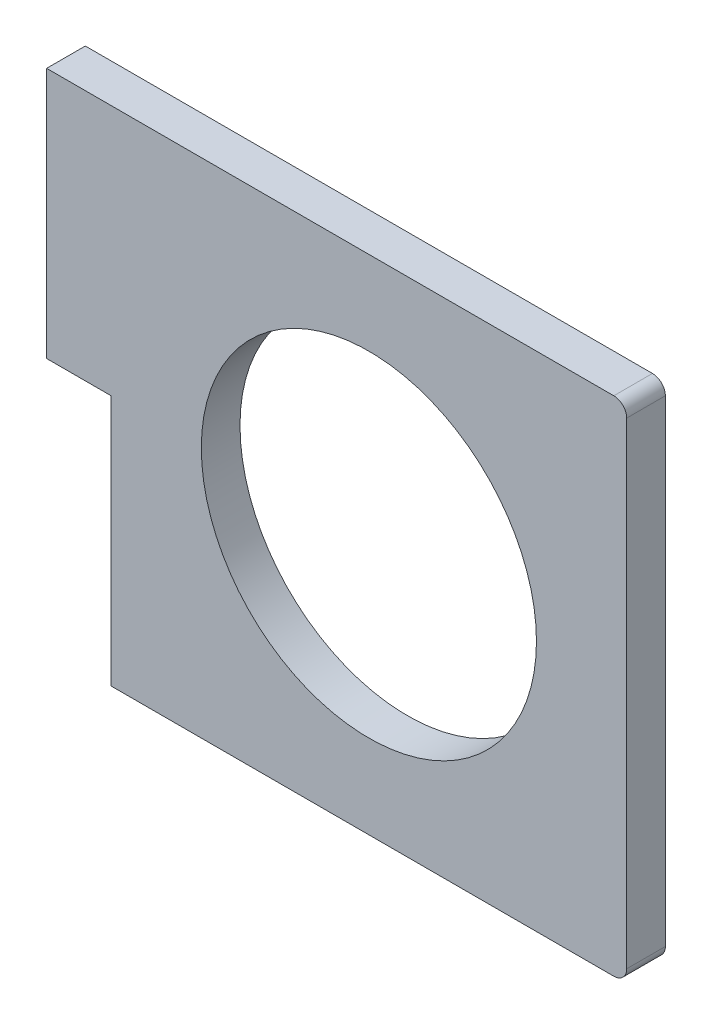
ISO-10303-21;
HEADER;
FILE_DESCRIPTION(('STEP AP214'),'2;1');
FILE_NAME('part.step','',(''),(''),'','','');
FILE_SCHEMA(('AUTOMOTIVE_DESIGN { 1 0 10303 214 1 1 1 1 }'));
ENDSEC;
DATA;
#1=APPLICATION_CONTEXT('core data for automotive mechanical design processes');
#2=APPLICATION_PROTOCOL_DEFINITION('international standard','automotive_design',2000,#1);
#3=PRODUCT_CONTEXT('',#1,'mechanical');
#4=PRODUCT('Part','Part','',(#3));
#5=PRODUCT_RELATED_PRODUCT_CATEGORY('part','',(#4));
#6=PRODUCT_DEFINITION_FORMATION('','',#4);
#7=PRODUCT_DEFINITION_CONTEXT('part definition',#1,'design');
#8=PRODUCT_DEFINITION('design','',#6,#7);
#9=PRODUCT_DEFINITION_SHAPE('','',#8);
#10=(LENGTH_UNIT() NAMED_UNIT(*) SI_UNIT(.MILLI.,.METRE.));
#11=(NAMED_UNIT(*) PLANE_ANGLE_UNIT() SI_UNIT($,.RADIAN.));
#12=(NAMED_UNIT(*) SI_UNIT($,.STERADIAN.) SOLID_ANGLE_UNIT());
#13=UNCERTAINTY_MEASURE_WITH_UNIT(LENGTH_MEASURE(1.E-05),#10,'distance_accuracy_value','');
#14=(GEOMETRIC_REPRESENTATION_CONTEXT(3) GLOBAL_UNCERTAINTY_ASSIGNED_CONTEXT((#13)) GLOBAL_UNIT_ASSIGNED_CONTEXT((#10,
#11,#12)) REPRESENTATION_CONTEXT('',''));
#15=CARTESIAN_POINT('',(0.,0.,0.));
#16=DIRECTION('',(0.,0.,1.));
#17=DIRECTION('',(1.,0.,0.));
#18=AXIS2_PLACEMENT_3D('',#15,#16,#17);
#19=CARTESIAN_POINT('',(0.,0.,6.));
#20=DIRECTION('',(0.,0.,1.));
#21=DIRECTION('',(1.,0.,0.));
#22=AXIS2_PLACEMENT_3D('',#19,#20,#21);
#23=PLANE('',#22);
#24=DIRECTION('',(1.,0.,0.));
#25=VECTOR('',#24,1.);
#26=CARTESIAN_POINT('',(0.,0.,6.));
#27=LINE('',#26,#25);
#28=CARTESIAN_POINT('',(0.,0.,6.));
#29=VERTEX_POINT('',#28);
#30=CARTESIAN_POINT('',(78.,0.,6.));
#31=VERTEX_POINT('',#30);
#32=EDGE_CURVE('E110',#29,#31,#27,.T.);
#33=ORIENTED_EDGE('',*,*,#32,.T.);
#34=CARTESIAN_POINT('',(78.,2.,6.));
#35=DIRECTION('',(0.,0.,1.));
#36=DIRECTION('',(1.,0.,0.));
#37=AXIS2_PLACEMENT_3D('',#34,#35,#36);
#38=CIRCLE('',#37,2.);
#39=CARTESIAN_POINT('',(80.,2.,6.));
#40=VERTEX_POINT('',#39);
#41=EDGE_CURVE('E53',#31,#40,#38,.T.);
#42=ORIENTED_EDGE('',*,*,#41,.T.);
#43=DIRECTION('',(0.,1.,0.));
#44=VECTOR('',#43,1.);
#45=CARTESIAN_POINT('',(80.,0.,6.));
#46=LINE('',#45,#44);
#47=CARTESIAN_POINT('',(80.,76.,6.));
#48=VERTEX_POINT('',#47);
#49=EDGE_CURVE('E118',#40,#48,#46,.T.);
#50=ORIENTED_EDGE('',*,*,#49,.T.);
#51=CARTESIAN_POINT('',(78.,76.,6.));
#52=DIRECTION('',(0.,0.,1.));
#53=DIRECTION('',(1.,0.,0.));
#54=AXIS2_PLACEMENT_3D('',#51,#52,#53);
#55=CIRCLE('',#54,2.);
#56=CARTESIAN_POINT('',(78.,78.,6.));
#57=VERTEX_POINT('',#56);
#58=EDGE_CURVE('E60',#48,#57,#55,.T.);
#59=ORIENTED_EDGE('',*,*,#58,.T.);
#60=DIRECTION('',(-1.,0.,0.));
#61=VECTOR('',#60,1.);
#62=CARTESIAN_POINT('',(0.,78.,6.));
#63=LINE('',#62,#61);
#64=CARTESIAN_POINT('',(-10.,78.,6.));
#65=VERTEX_POINT('',#64);
#66=EDGE_CURVE('E169',#57,#65,#63,.T.);
#67=ORIENTED_EDGE('',*,*,#66,.T.);
#68=DIRECTION('',(0.,-1.,0.));
#69=VECTOR('',#68,1.);
#70=CARTESIAN_POINT('',(-10.,78.,6.));
#71=LINE('',#70,#69);
#72=CARTESIAN_POINT('',(-9.99999999999999,39.,6.));
#73=VERTEX_POINT('',#72);
#74=EDGE_CURVE('E208',#65,#73,#71,.T.);
#75=ORIENTED_EDGE('',*,*,#74,.T.);
#76=DIRECTION('',(1.,0.,0.));
#77=VECTOR('',#76,1.);
#78=CARTESIAN_POINT('',(0.,39.,6.));
#79=LINE('',#78,#77);
#80=CARTESIAN_POINT('',(0.,39.,6.));
#81=VERTEX_POINT('',#80);
#82=EDGE_CURVE('E124',#73,#81,#79,.T.);
#83=ORIENTED_EDGE('',*,*,#82,.T.);
#84=DIRECTION('',(0.,-1.,0.));
#85=VECTOR('',#84,1.);
#86=CARTESIAN_POINT('',(0.,0.,6.));
#87=LINE('',#86,#85);
#88=EDGE_CURVE('E119',#81,#29,#87,.T.);
#89=ORIENTED_EDGE('',*,*,#88,.T.);
#90=EDGE_LOOP('',(#33,#42,#50,#59,#67,#75,#83,#89));
#91=FACE_BOUND('',#90,.T.);
#92=CARTESIAN_POINT('',(40.,39.,6.));
#93=DIRECTION('',(0.,0.,1.));
#94=DIRECTION('',(1.,0.,0.));
#95=AXIS2_PLACEMENT_3D('',#92,#93,#94);
#96=CIRCLE('',#95,26.);
#97=CARTESIAN_POINT('',(66.,39.,6.));
#98=VERTEX_POINT('',#97);
#99=EDGE_CURVE('E183',#98,#98,#96,.T.);
#100=ORIENTED_EDGE('',*,*,#99,.F.);
#101=EDGE_LOOP('',(#100));
#102=FACE_BOUND('',#101,.T.);
#103=ADVANCED_FACE('F44',(#91,#102),#23,.T.);
#104=CARTESIAN_POINT('',(0.,0.,0.));
#105=DIRECTION('',(0.,0.,1.));
#106=DIRECTION('',(1.,0.,0.));
#107=AXIS2_PLACEMENT_3D('',#104,#105,#106);
#108=PLANE('',#107);
#109=DIRECTION('',(0.,1.,0.));
#110=VECTOR('',#109,1.);
#111=CARTESIAN_POINT('',(80.,0.,0.));
#112=LINE('',#111,#110);
#113=CARTESIAN_POINT('',(80.,2.,0.));
#114=VERTEX_POINT('',#113);
#115=CARTESIAN_POINT('',(80.,76.,0.));
#116=VERTEX_POINT('',#115);
#117=EDGE_CURVE('E176',#114,#116,#112,.T.);
#118=ORIENTED_EDGE('',*,*,#117,.F.);
#119=CARTESIAN_POINT('',(78.,2.,0.));
#120=DIRECTION('',(0.,0.,1.));
#121=DIRECTION('',(1.,0.,0.));
#122=AXIS2_PLACEMENT_3D('',#119,#120,#121);
#123=CIRCLE('',#122,2.);
#124=CARTESIAN_POINT('',(78.,0.,0.));
#125=VERTEX_POINT('',#124);
#126=EDGE_CURVE('E153',#114,#125,#123,.F.);
#127=ORIENTED_EDGE('',*,*,#126,.T.);
#128=DIRECTION('',(1.,0.,0.));
#129=VECTOR('',#128,1.);
#130=CARTESIAN_POINT('',(0.,0.,0.));
#131=LINE('',#130,#129);
#132=CARTESIAN_POINT('',(0.,0.,0.));
#133=VERTEX_POINT('',#132);
#134=EDGE_CURVE('E175',#133,#125,#131,.T.);
#135=ORIENTED_EDGE('',*,*,#134,.F.);
#136=DIRECTION('',(0.,-1.,0.));
#137=VECTOR('',#136,1.);
#138=CARTESIAN_POINT('',(0.,0.,0.));
#139=LINE('',#138,#137);
#140=CARTESIAN_POINT('',(0.,39.,0.));
#141=VERTEX_POINT('',#140);
#142=EDGE_CURVE('E133',#141,#133,#139,.T.);
#143=ORIENTED_EDGE('',*,*,#142,.F.);
#144=DIRECTION('',(1.,0.,0.));
#145=VECTOR('',#144,1.);
#146=CARTESIAN_POINT('',(0.,39.,0.));
#147=LINE('',#146,#145);
#148=CARTESIAN_POINT('',(-9.99999999999999,39.,0.));
#149=VERTEX_POINT('',#148);
#150=EDGE_CURVE('E129',#149,#141,#147,.T.);
#151=ORIENTED_EDGE('',*,*,#150,.F.);
#152=DIRECTION('',(0.,-1.,0.));
#153=VECTOR('',#152,1.);
#154=CARTESIAN_POINT('',(-10.,78.,0.));
#155=LINE('',#154,#153);
#156=CARTESIAN_POINT('',(-10.,78.,0.));
#157=VERTEX_POINT('',#156);
#158=EDGE_CURVE('E189',#157,#149,#155,.T.);
#159=ORIENTED_EDGE('',*,*,#158,.F.);
#160=DIRECTION('',(-1.,0.,0.));
#161=VECTOR('',#160,1.);
#162=CARTESIAN_POINT('',(0.,78.,0.));
#163=LINE('',#162,#161);
#164=CARTESIAN_POINT('',(78.,78.,0.));
#165=VERTEX_POINT('',#164);
#166=EDGE_CURVE('E181',#165,#157,#163,.T.);
#167=ORIENTED_EDGE('',*,*,#166,.F.);
#168=CARTESIAN_POINT('',(78.,76.,0.));
#169=DIRECTION('',(0.,0.,1.));
#170=DIRECTION('',(1.,0.,0.));
#171=AXIS2_PLACEMENT_3D('',#168,#169,#170);
#172=CIRCLE('',#171,2.);
#173=EDGE_CURVE('E150',#165,#116,#172,.F.);
#174=ORIENTED_EDGE('',*,*,#173,.T.);
#175=EDGE_LOOP('',(#118,#127,#135,#143,#151,#159,#167,#174));
#176=FACE_BOUND('',#175,.T.);
#177=CARTESIAN_POINT('',(40.,39.,0.));
#178=DIRECTION('',(0.,0.,1.));
#179=DIRECTION('',(1.,0.,0.));
#180=AXIS2_PLACEMENT_3D('',#177,#178,#179);
#181=CIRCLE('',#180,26.);
#182=CARTESIAN_POINT('',(66.,39.,0.));
#183=VERTEX_POINT('',#182);
#184=EDGE_CURVE('E309',#183,#183,#181,.T.);
#185=ORIENTED_EDGE('',*,*,#184,.T.);
#186=EDGE_LOOP('',(#185));
#187=FACE_BOUND('',#186,.T.);
#188=ADVANCED_FACE('F173',(#176,#187),#108,.F.);
#189=CARTESIAN_POINT('',(0.,0.,6.));
#190=DIRECTION('',(1.,0.,0.));
#191=DIRECTION('',(0.,1.,0.));
#192=AXIS2_PLACEMENT_3D('',#189,#190,#191);
#193=PLANE('',#192);
#194=ORIENTED_EDGE('',*,*,#142,.T.);
#195=DIRECTION('',(0.,0.,-1.));
#196=VECTOR('',#195,1.);
#197=CARTESIAN_POINT('',(0.,0.,6.));
#198=LINE('',#197,#196);
#199=EDGE_CURVE('E114',#29,#133,#198,.T.);
#200=ORIENTED_EDGE('',*,*,#199,.F.);
#201=ORIENTED_EDGE('',*,*,#88,.F.);
#202=DIRECTION('',(0.,0.,-1.));
#203=VECTOR('',#202,1.);
#204=CARTESIAN_POINT('',(0.,39.,6.));
#205=LINE('',#204,#203);
#206=EDGE_CURVE('E194',#81,#141,#205,.T.);
#207=ORIENTED_EDGE('',*,*,#206,.T.);
#208=EDGE_LOOP('',(#194,#200,#201,#207));
#209=FACE_BOUND('',#208,.T.);
#210=ADVANCED_FACE('F131',(#209),#193,.F.);
#211=CARTESIAN_POINT('',(0.,0.,6.));
#212=DIRECTION('',(0.,1.,0.));
#213=DIRECTION('',(0.,0.,1.));
#214=AXIS2_PLACEMENT_3D('',#211,#212,#213);
#215=PLANE('',#214);
#216=ORIENTED_EDGE('',*,*,#134,.T.);
#217=DIRECTION('',(0.,0.,-1.));
#218=VECTOR('',#217,1.);
#219=CARTESIAN_POINT('',(78.,0.,6.));
#220=LINE('',#219,#218);
#221=EDGE_CURVE('E68',#125,#31,#220,.F.);
#222=ORIENTED_EDGE('',*,*,#221,.T.);
#223=ORIENTED_EDGE('',*,*,#32,.F.);
#224=ORIENTED_EDGE('',*,*,#199,.T.);
#225=EDGE_LOOP('',(#216,#222,#223,#224));
#226=FACE_BOUND('',#225,.T.);
#227=ADVANCED_FACE('F112',(#226),#215,.F.);
#228=CARTESIAN_POINT('',(80.,0.,6.));
#229=DIRECTION('',(-1.,0.,0.));
#230=DIRECTION('',(0.,0.,1.));
#231=AXIS2_PLACEMENT_3D('',#228,#229,#230);
#232=PLANE('',#231);
#233=ORIENTED_EDGE('',*,*,#49,.F.);
#234=DIRECTION('',(0.,0.,-1.));
#235=VECTOR('',#234,1.);
#236=CARTESIAN_POINT('',(80.,2.,6.));
#237=LINE('',#236,#235);
#238=EDGE_CURVE('E140',#40,#114,#237,.T.);
#239=ORIENTED_EDGE('',*,*,#238,.T.);
#240=ORIENTED_EDGE('',*,*,#117,.T.);
#241=DIRECTION('',(0.,0.,-1.));
#242=VECTOR('',#241,1.);
#243=CARTESIAN_POINT('',(80.,76.,6.));
#244=LINE('',#243,#242);
#245=EDGE_CURVE('E135',#116,#48,#244,.F.);
#246=ORIENTED_EDGE('',*,*,#245,.T.);
#247=EDGE_LOOP('',(#233,#239,#240,#246));
#248=FACE_BOUND('',#247,.T.);
#249=ADVANCED_FACE('F164',(#248),#232,.F.);
#250=CARTESIAN_POINT('',(0.,78.,6.));
#251=DIRECTION('',(0.,-1.,0.));
#252=DIRECTION('',(0.,0.,-1.));
#253=AXIS2_PLACEMENT_3D('',#250,#251,#252);
#254=PLANE('',#253);
#255=ORIENTED_EDGE('',*,*,#66,.F.);
#256=DIRECTION('',(0.,0.,-1.));
#257=VECTOR('',#256,1.);
#258=CARTESIAN_POINT('',(78.,78.,6.));
#259=LINE('',#258,#257);
#260=EDGE_CURVE('E11',#57,#165,#259,.T.);
#261=ORIENTED_EDGE('',*,*,#260,.T.);
#262=ORIENTED_EDGE('',*,*,#166,.T.);
#263=DIRECTION('',(0.,0.,-1.));
#264=VECTOR('',#263,1.);
#265=CARTESIAN_POINT('',(-10.,78.,6.));
#266=LINE('',#265,#264);
#267=EDGE_CURVE('E136',#65,#157,#266,.T.);
#268=ORIENTED_EDGE('',*,*,#267,.F.);
#269=EDGE_LOOP('',(#255,#261,#262,#268));
#270=FACE_BOUND('',#269,.T.);
#271=ADVANCED_FACE('F210',(#270),#254,.F.);
#272=CARTESIAN_POINT('',(-10.,78.,6.));
#273=DIRECTION('',(1.,0.,0.));
#274=DIRECTION('',(0.,1.,0.));
#275=AXIS2_PLACEMENT_3D('',#272,#273,#274);
#276=PLANE('',#275);
#277=ORIENTED_EDGE('',*,*,#158,.T.);
#278=DIRECTION('',(0.,0.,-1.));
#279=VECTOR('',#278,1.);
#280=CARTESIAN_POINT('',(-9.99999999999999,39.,6.));
#281=LINE('',#280,#279);
#282=EDGE_CURVE('E143',#73,#149,#281,.T.);
#283=ORIENTED_EDGE('',*,*,#282,.F.);
#284=ORIENTED_EDGE('',*,*,#74,.F.);
#285=ORIENTED_EDGE('',*,*,#267,.T.);
#286=EDGE_LOOP('',(#277,#283,#284,#285));
#287=FACE_BOUND('',#286,.T.);
#288=ADVANCED_FACE('F206',(#287),#276,.F.);
#289=CARTESIAN_POINT('',(0.,39.,6.));
#290=DIRECTION('',(0.,1.,0.));
#291=DIRECTION('',(0.,0.,1.));
#292=AXIS2_PLACEMENT_3D('',#289,#290,#291);
#293=PLANE('',#292);
#294=ORIENTED_EDGE('',*,*,#150,.T.);
#295=ORIENTED_EDGE('',*,*,#206,.F.);
#296=ORIENTED_EDGE('',*,*,#82,.F.);
#297=ORIENTED_EDGE('',*,*,#282,.T.);
#298=EDGE_LOOP('',(#294,#295,#296,#297));
#299=FACE_BOUND('',#298,.T.);
#300=ADVANCED_FACE('F201',(#299),#293,.F.);
#301=CARTESIAN_POINT('',(40.,39.,6.));
#302=DIRECTION('',(0.,0.,-1.));
#303=DIRECTION('',(-1.,0.,0.));
#304=AXIS2_PLACEMENT_3D('',#301,#302,#303);
#305=CYLINDRICAL_SURFACE('',#304,26.);
#306=ORIENTED_EDGE('',*,*,#99,.T.);
#307=EDGE_LOOP('',(#306));
#308=FACE_BOUND('',#307,.T.);
#309=ORIENTED_EDGE('',*,*,#184,.F.);
#310=EDGE_LOOP('',(#309));
#311=FACE_BOUND('',#310,.T.);
#312=ADVANCED_FACE('F217',(#308,#311),#305,.F.);
#313=CARTESIAN_POINT('',(78.,2.,6.));
#314=DIRECTION('',(0.,0.,-1.));
#315=DIRECTION('',(-1.,0.,0.));
#316=AXIS2_PLACEMENT_3D('',#313,#314,#315);
#317=CYLINDRICAL_SURFACE('',#316,2.);
#318=ORIENTED_EDGE('',*,*,#41,.F.);
#319=ORIENTED_EDGE('',*,*,#221,.F.);
#320=ORIENTED_EDGE('',*,*,#126,.F.);
#321=ORIENTED_EDGE('',*,*,#238,.F.);
#322=EDGE_LOOP('',(#318,#319,#320,#321));
#323=FACE_BOUND('',#322,.T.);
#324=ADVANCED_FACE('F171',(#323),#317,.T.);
#325=CARTESIAN_POINT('',(78.,76.,6.));
#326=DIRECTION('',(0.,0.,-1.));
#327=DIRECTION('',(-1.,0.,0.));
#328=AXIS2_PLACEMENT_3D('',#325,#326,#327);
#329=CYLINDRICAL_SURFACE('',#328,2.);
#330=ORIENTED_EDGE('',*,*,#58,.F.);
#331=ORIENTED_EDGE('',*,*,#245,.F.);
#332=ORIENTED_EDGE('',*,*,#173,.F.);
#333=ORIENTED_EDGE('',*,*,#260,.F.);
#334=EDGE_LOOP('',(#330,#331,#332,#333));
#335=FACE_BOUND('',#334,.T.);
#336=ADVANCED_FACE('F46',(#335),#329,.T.);
#337=CLOSED_SHELL('',(#103,#188,#210,#227,#249,#271,#288,#300,#312,#324,#336));
#338=MANIFOLD_SOLID_BREP('B2',#337);
#339=ADVANCED_BREP_SHAPE_REPRESENTATION('',(#18,#338),#14);
#340=SHAPE_DEFINITION_REPRESENTATION(#9,#339);
ENDSEC;
END-ISO-10303-21;
